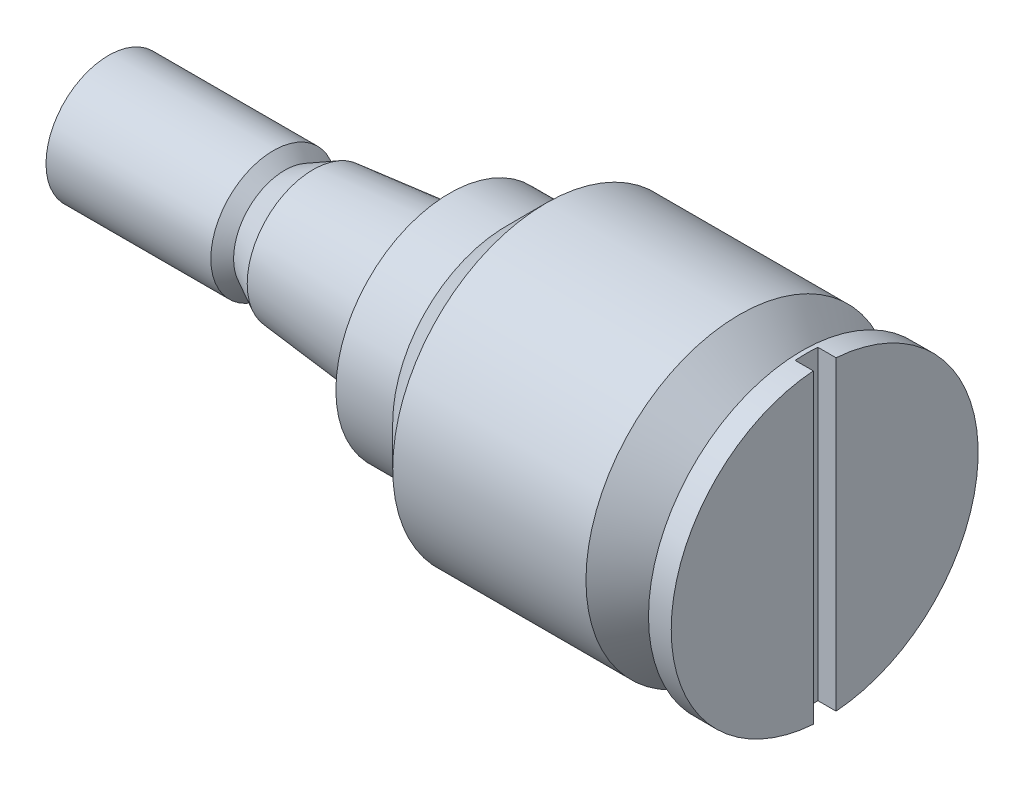
ISO-10303-21;
HEADER;
FILE_DESCRIPTION(('STEP AP214'),'2;1');
FILE_NAME('part.step','',(''),(''),'','','');
FILE_SCHEMA(('AUTOMOTIVE_DESIGN { 1 0 10303 214 1 1 1 1 }'));
ENDSEC;
DATA;
#1=APPLICATION_CONTEXT('core data for automotive mechanical design processes');
#2=APPLICATION_PROTOCOL_DEFINITION('international standard','automotive_design',2000,#1);
#3=PRODUCT_CONTEXT('',#1,'mechanical');
#4=PRODUCT('Part','Part','',(#3));
#5=PRODUCT_RELATED_PRODUCT_CATEGORY('part','',(#4));
#6=PRODUCT_DEFINITION_FORMATION('','',#4);
#7=PRODUCT_DEFINITION_CONTEXT('part definition',#1,'design');
#8=PRODUCT_DEFINITION('design','',#6,#7);
#9=PRODUCT_DEFINITION_SHAPE('','',#8);
#10=(LENGTH_UNIT() NAMED_UNIT(*) SI_UNIT(.MILLI.,.METRE.));
#11=(NAMED_UNIT(*) PLANE_ANGLE_UNIT() SI_UNIT($,.RADIAN.));
#12=(NAMED_UNIT(*) SI_UNIT($,.STERADIAN.) SOLID_ANGLE_UNIT());
#13=UNCERTAINTY_MEASURE_WITH_UNIT(LENGTH_MEASURE(1.E-05),#10,'distance_accuracy_value','');
#14=(GEOMETRIC_REPRESENTATION_CONTEXT(3) GLOBAL_UNCERTAINTY_ASSIGNED_CONTEXT((#13)) GLOBAL_UNIT_ASSIGNED_CONTEXT((#10,
#11,#12)) REPRESENTATION_CONTEXT('',''));
#15=CARTESIAN_POINT('',(0.,0.,0.));
#16=DIRECTION('',(0.,0.,1.));
#17=DIRECTION('',(1.,0.,0.));
#18=AXIS2_PLACEMENT_3D('',#15,#16,#17);
#19=CARTESIAN_POINT('',(31.5,0.,0.));
#20=DIRECTION('',(-1.,0.,0.));
#21=DIRECTION('',(0.,0.,1.));
#22=AXIS2_PLACEMENT_3D('',#19,#20,#21);
#23=PLANE('',#22);
#24=CARTESIAN_POINT('',(31.5,0.,0.));
#25=DIRECTION('',(-1.,0.,0.));
#26=DIRECTION('',(0.,0.,1.));
#27=AXIS2_PLACEMENT_3D('',#24,#25,#26);
#28=CIRCLE('',#27,13.5);
#29=CARTESIAN_POINT('',(31.5,13.4629120178363,-1.));
#30=VERTEX_POINT('',#29);
#31=CARTESIAN_POINT('',(31.5,-13.4629120178363,-1.));
#32=VERTEX_POINT('',#31);
#33=EDGE_CURVE('E91',#30,#32,#28,.T.);
#34=ORIENTED_EDGE('',*,*,#33,.F.);
#35=DIRECTION('',(0.,1.,0.));
#36=VECTOR('',#35,1.);
#37=CARTESIAN_POINT('',(31.5,-13.5,-1.));
#38=LINE('',#37,#36);
#39=EDGE_CURVE('E87',#32,#30,#38,.T.);
#40=ORIENTED_EDGE('',*,*,#39,.F.);
#41=EDGE_LOOP('',(#34,#40));
#42=FACE_BOUND('',#41,.T.);
#43=ADVANCED_FACE('F35',(#42),#23,.F.);
#44=CARTESIAN_POINT('',(-31.5,5.5,0.));
#45=DIRECTION('',(1.,0.,0.));
#46=DIRECTION('',(0.,0.,-1.));
#47=AXIS2_PLACEMENT_3D('',#44,#45,#46);
#48=PLANE('',#47);
#49=CARTESIAN_POINT('',(-31.5,0.,0.));
#50=DIRECTION('',(-1.,0.,0.));
#51=DIRECTION('',(0.,0.,1.));
#52=AXIS2_PLACEMENT_3D('',#49,#50,#51);
#53=CIRCLE('',#52,5.5);
#54=CARTESIAN_POINT('',(-31.5,0.,5.5));
#55=VERTEX_POINT('',#54);
#56=EDGE_CURVE('E109',#55,#55,#53,.T.);
#57=ORIENTED_EDGE('',*,*,#56,.T.);
#58=EDGE_LOOP('',(#57));
#59=FACE_BOUND('',#58,.T.);
#60=ADVANCED_FACE('F37',(#59),#48,.F.);
#61=CARTESIAN_POINT('',(31.5,-13.4629120178363,1.00000000000004));
#62=VERTEX_POINT('',#61);
#63=CARTESIAN_POINT('',(31.5,13.4629120178363,1.));
#64=VERTEX_POINT('',#63);
#65=EDGE_CURVE('E86',#62,#64,#28,.T.);
#66=ORIENTED_EDGE('',*,*,#65,.F.);
#67=DIRECTION('',(0.,1.,0.));
#68=VECTOR('',#67,1.);
#69=CARTESIAN_POINT('',(31.5,-13.5,1.));
#70=LINE('',#69,#68);
#71=EDGE_CURVE('E50',#62,#64,#70,.T.);
#72=ORIENTED_EDGE('',*,*,#71,.T.);
#73=EDGE_LOOP('',(#66,#72));
#74=FACE_BOUND('',#73,.T.);
#75=ADVANCED_FACE('F85',(#74),#23,.F.);
#76=CARTESIAN_POINT('',(-261.918227012937,0.,0.));
#77=DIRECTION('',(-1.,0.,0.));
#78=DIRECTION('',(0.,0.,1.));
#79=AXIS2_PLACEMENT_3D('',#76,#77,#78);
#80=CYLINDRICAL_SURFACE('',#79,13.5);
#81=CARTESIAN_POINT('',(29.5,0.,0.));
#82=DIRECTION('',(-1.,0.,0.));
#83=DIRECTION('',(0.,0.,1.));
#84=AXIS2_PLACEMENT_3D('',#81,#82,#83);
#85=CIRCLE('',#84,13.5);
#86=CARTESIAN_POINT('',(29.5,0.,13.5));
#87=VERTEX_POINT('',#86);
#88=EDGE_CURVE('E92',#87,#87,#85,.T.);
#89=ORIENTED_EDGE('',*,*,#88,.F.);
#90=EDGE_LOOP('',(#89));
#91=FACE_BOUND('',#90,.T.);
#92=DIRECTION('',(-1.,0.,0.));
#93=VECTOR('',#92,1.);
#94=CARTESIAN_POINT('',(-261.918227012937,-13.4629120178363,-0.999999999999921));
#95=LINE('',#94,#93);
#96=CARTESIAN_POINT('',(29.9,-13.4629120178363,-1.));
#97=VERTEX_POINT('',#96);
#98=EDGE_CURVE('E11',#32,#97,#95,.T.);
#99=ORIENTED_EDGE('',*,*,#98,.T.);
#100=CARTESIAN_POINT('',(29.9,0.,0.));
#101=DIRECTION('',(-1.,0.,0.));
#102=DIRECTION('',(0.,0.,1.));
#103=AXIS2_PLACEMENT_3D('',#100,#101,#102);
#104=CIRCLE('',#103,13.5);
#105=CARTESIAN_POINT('',(29.9,-13.4629120178363,1.));
#106=VERTEX_POINT('',#105);
#107=EDGE_CURVE('E102',#97,#106,#104,.T.);
#108=ORIENTED_EDGE('',*,*,#107,.T.);
#109=DIRECTION('',(-1.,0.,0.));
#110=VECTOR('',#109,1.);
#111=CARTESIAN_POINT('',(-261.918227012937,-13.4629120178363,1.00000000000004));
#112=LINE('',#111,#110);
#113=EDGE_CURVE('E82',#106,#62,#112,.F.);
#114=ORIENTED_EDGE('',*,*,#113,.T.);
#115=ORIENTED_EDGE('',*,*,#65,.T.);
#116=DIRECTION('',(-1.,0.,0.));
#117=VECTOR('',#116,1.);
#118=CARTESIAN_POINT('',(-261.918227012937,13.4629120178363,1.00000000000004));
#119=LINE('',#118,#117);
#120=CARTESIAN_POINT('',(29.9,13.4629120178363,1.));
#121=VERTEX_POINT('',#120);
#122=EDGE_CURVE('E43',#64,#121,#119,.T.);
#123=ORIENTED_EDGE('',*,*,#122,.T.);
#124=CARTESIAN_POINT('',(29.9,13.4629120178363,-1.));
#125=VERTEX_POINT('',#124);
#126=EDGE_CURVE('E95',#121,#125,#104,.T.);
#127=ORIENTED_EDGE('',*,*,#126,.T.);
#128=DIRECTION('',(-1.,0.,0.));
#129=VECTOR('',#128,1.);
#130=CARTESIAN_POINT('',(-261.918227012937,13.4629120178363,-0.999999999999921));
#131=LINE('',#130,#129);
#132=EDGE_CURVE('E58',#125,#30,#131,.F.);
#133=ORIENTED_EDGE('',*,*,#132,.T.);
#134=ORIENTED_EDGE('',*,*,#33,.T.);
#135=EDGE_LOOP('',(#99,#108,#114,#115,#123,#127,#133,#134));
#136=FACE_BOUND('',#135,.T.);
#137=ADVANCED_FACE('F89',(#91,#136),#80,.T.);
#138=CARTESIAN_POINT('',(29.5,13.5,0.));
#139=DIRECTION('',(1.,0.,0.));
#140=DIRECTION('',(0.,0.,-1.));
#141=AXIS2_PLACEMENT_3D('',#138,#139,#140);
#142=PLANE('',#141);
#143=CARTESIAN_POINT('',(29.5,0.,0.));
#144=DIRECTION('',(-1.,0.,0.));
#145=DIRECTION('',(0.,0.,1.));
#146=AXIS2_PLACEMENT_3D('',#143,#144,#145);
#147=CIRCLE('',#146,9.99999999999997);
#148=CARTESIAN_POINT('',(29.5,0.,9.99999999999997));
#149=VERTEX_POINT('',#148);
#150=EDGE_CURVE('E97',#149,#149,#147,.T.);
#151=ORIENTED_EDGE('',*,*,#150,.F.);
#152=EDGE_LOOP('',(#151));
#153=FACE_BOUND('',#152,.T.);
#154=ORIENTED_EDGE('',*,*,#88,.T.);
#155=EDGE_LOOP('',(#154));
#156=FACE_BOUND('',#155,.T.);
#157=ADVANCED_FACE('F147',(#153,#156),#142,.F.);
#158=CARTESIAN_POINT('',(-261.918227012937,0.,0.));
#159=DIRECTION('',(-1.,0.,0.));
#160=DIRECTION('',(0.,0.,1.));
#161=AXIS2_PLACEMENT_3D('',#158,#159,#160);
#162=CYLINDRICAL_SURFACE('',#161,9.99999999999998);
#163=CARTESIAN_POINT('',(27.5,0.,0.));
#164=DIRECTION('',(-1.,0.,0.));
#165=DIRECTION('',(0.,0.,1.));
#166=AXIS2_PLACEMENT_3D('',#163,#164,#165);
#167=CIRCLE('',#166,10.);
#168=CARTESIAN_POINT('',(27.5,0.,10.));
#169=VERTEX_POINT('',#168);
#170=EDGE_CURVE('E140',#169,#169,#167,.T.);
#171=ORIENTED_EDGE('',*,*,#170,.F.);
#172=EDGE_LOOP('',(#171));
#173=FACE_BOUND('',#172,.T.);
#174=ORIENTED_EDGE('',*,*,#150,.T.);
#175=EDGE_LOOP('',(#174));
#176=FACE_BOUND('',#175,.T.);
#177=ADVANCED_FACE('F145',(#173,#176),#162,.T.);
#178=CARTESIAN_POINT('',(27.5,0.,0.));
#179=DIRECTION('',(-1.,0.,0.));
#180=DIRECTION('',(0.,0.,1.));
#181=AXIS2_PLACEMENT_3D('',#178,#179,#180);
#182=CONICAL_SURFACE('',#181,10.,0.785398163397446);
#183=CARTESIAN_POINT('',(24.,0.,0.));
#184=DIRECTION('',(-1.,0.,0.));
#185=DIRECTION('',(0.,0.,1.));
#186=AXIS2_PLACEMENT_3D('',#183,#184,#185);
#187=CIRCLE('',#186,13.5);
#188=CARTESIAN_POINT('',(24.,0.,13.5));
#189=VERTEX_POINT('',#188);
#190=EDGE_CURVE('E137',#189,#189,#187,.T.);
#191=ORIENTED_EDGE('',*,*,#190,.F.);
#192=EDGE_LOOP('',(#191));
#193=FACE_BOUND('',#192,.T.);
#194=ORIENTED_EDGE('',*,*,#170,.T.);
#195=EDGE_LOOP('',(#194));
#196=FACE_BOUND('',#195,.T.);
#197=ADVANCED_FACE('F214',(#193,#196),#182,.T.);
#198=CARTESIAN_POINT('',(-261.918227012937,0.,0.));
#199=DIRECTION('',(-1.,0.,0.));
#200=DIRECTION('',(0.,0.,1.));
#201=AXIS2_PLACEMENT_3D('',#198,#199,#200);
#202=CYLINDRICAL_SURFACE('',#201,13.5);
#203=CARTESIAN_POINT('',(7.00000000000001,0.,0.));
#204=DIRECTION('',(-1.,0.,0.));
#205=DIRECTION('',(0.,0.,1.));
#206=AXIS2_PLACEMENT_3D('',#203,#204,#205);
#207=CIRCLE('',#206,13.5);
#208=CARTESIAN_POINT('',(7.00000000000001,0.,13.5));
#209=VERTEX_POINT('',#208);
#210=EDGE_CURVE('E134',#209,#209,#207,.T.);
#211=ORIENTED_EDGE('',*,*,#210,.F.);
#212=EDGE_LOOP('',(#211));
#213=FACE_BOUND('',#212,.T.);
#214=ORIENTED_EDGE('',*,*,#190,.T.);
#215=EDGE_LOOP('',(#214));
#216=FACE_BOUND('',#215,.T.);
#217=ADVANCED_FACE('F208',(#213,#216),#202,.T.);
#218=CARTESIAN_POINT('',(7.00000000000001,0.,0.));
#219=DIRECTION('',(1.,0.,0.));
#220=DIRECTION('',(0.,0.,-1.));
#221=AXIS2_PLACEMENT_3D('',#218,#219,#220);
#222=CONICAL_SURFACE('',#221,13.5,0.785398163397455);
#223=CARTESIAN_POINT('',(3.50000000000006,0.,0.));
#224=DIRECTION('',(-1.,0.,0.));
#225=DIRECTION('',(0.,0.,1.));
#226=AXIS2_PLACEMENT_3D('',#223,#224,#225);
#227=CIRCLE('',#226,9.99999999999999);
#228=CARTESIAN_POINT('',(3.50000000000006,0.,9.99999999999999));
#229=VERTEX_POINT('',#228);
#230=EDGE_CURVE('E131',#229,#229,#227,.T.);
#231=ORIENTED_EDGE('',*,*,#230,.F.);
#232=EDGE_LOOP('',(#231));
#233=FACE_BOUND('',#232,.T.);
#234=ORIENTED_EDGE('',*,*,#210,.T.);
#235=EDGE_LOOP('',(#234));
#236=FACE_BOUND('',#235,.T.);
#237=ADVANCED_FACE('F202',(#233,#236),#222,.T.);
#238=CARTESIAN_POINT('',(-261.918227012937,0.,0.));
#239=DIRECTION('',(-1.,0.,0.));
#240=DIRECTION('',(0.,0.,1.));
#241=AXIS2_PLACEMENT_3D('',#238,#239,#240);
#242=CYLINDRICAL_SURFACE('',#241,10.);
#243=CARTESIAN_POINT('',(-1.5,0.,0.));
#244=DIRECTION('',(-1.,0.,0.));
#245=DIRECTION('',(0.,0.,1.));
#246=AXIS2_PLACEMENT_3D('',#243,#244,#245);
#247=CIRCLE('',#246,10.);
#248=CARTESIAN_POINT('',(-1.5,0.,10.));
#249=VERTEX_POINT('',#248);
#250=EDGE_CURVE('E128',#249,#249,#247,.T.);
#251=ORIENTED_EDGE('',*,*,#250,.F.);
#252=EDGE_LOOP('',(#251));
#253=FACE_BOUND('',#252,.T.);
#254=ORIENTED_EDGE('',*,*,#230,.T.);
#255=EDGE_LOOP('',(#254));
#256=FACE_BOUND('',#255,.T.);
#257=ADVANCED_FACE('F196',(#253,#256),#242,.T.);
#258=CARTESIAN_POINT('',(-1.5,7.,0.));
#259=DIRECTION('',(1.,0.,0.));
#260=DIRECTION('',(0.,0.,-1.));
#261=AXIS2_PLACEMENT_3D('',#258,#259,#260);
#262=PLANE('',#261);
#263=CARTESIAN_POINT('',(-1.5,0.,0.));
#264=DIRECTION('',(-1.,0.,0.));
#265=DIRECTION('',(0.,0.,1.));
#266=AXIS2_PLACEMENT_3D('',#263,#264,#265);
#267=CIRCLE('',#266,7.);
#268=CARTESIAN_POINT('',(-1.5,0.,7.));
#269=VERTEX_POINT('',#268);
#270=EDGE_CURVE('E125',#269,#269,#267,.T.);
#271=ORIENTED_EDGE('',*,*,#270,.F.);
#272=EDGE_LOOP('',(#271));
#273=FACE_BOUND('',#272,.T.);
#274=ORIENTED_EDGE('',*,*,#250,.T.);
#275=EDGE_LOOP('',(#274));
#276=FACE_BOUND('',#275,.T.);
#277=ADVANCED_FACE('F190',(#273,#276),#262,.F.);
#278=CARTESIAN_POINT('',(-1.5,0.,0.));
#279=DIRECTION('',(1.,0.,0.));
#280=DIRECTION('',(0.,0.,-1.));
#281=AXIS2_PLACEMENT_3D('',#278,#279,#280);
#282=CONICAL_SURFACE('',#281,7.,0.0996686524911621);
#283=CARTESIAN_POINT('',(-13.5,0.,0.));
#284=DIRECTION('',(-1.,0.,0.));
#285=DIRECTION('',(0.,0.,1.));
#286=AXIS2_PLACEMENT_3D('',#283,#284,#285);
#287=CIRCLE('',#286,5.8);
#288=CARTESIAN_POINT('',(-13.5,0.,5.8));
#289=VERTEX_POINT('',#288);
#290=EDGE_CURVE('E122',#289,#289,#287,.T.);
#291=ORIENTED_EDGE('',*,*,#290,.F.);
#292=EDGE_LOOP('',(#291));
#293=FACE_BOUND('',#292,.T.);
#294=ORIENTED_EDGE('',*,*,#270,.T.);
#295=EDGE_LOOP('',(#294));
#296=FACE_BOUND('',#295,.T.);
#297=ADVANCED_FACE('F184',(#293,#296),#282,.T.);
#298=CARTESIAN_POINT('',(-13.5,0.,0.));
#299=DIRECTION('',(1.,0.,0.));
#300=DIRECTION('',(0.,0.,-1.));
#301=AXIS2_PLACEMENT_3D('',#298,#299,#300);
#302=CONICAL_SURFACE('',#301,5.8,0.479519291992596);
#303=CARTESIAN_POINT('',(-16.,0.,0.));
#304=DIRECTION('',(-1.,0.,0.));
#305=DIRECTION('',(0.,0.,1.));
#306=AXIS2_PLACEMENT_3D('',#303,#304,#305);
#307=CIRCLE('',#306,4.5);
#308=CARTESIAN_POINT('',(-16.,0.,4.5));
#309=VERTEX_POINT('',#308);
#310=EDGE_CURVE('E119',#309,#309,#307,.T.);
#311=ORIENTED_EDGE('',*,*,#310,.F.);
#312=EDGE_LOOP('',(#311));
#313=FACE_BOUND('',#312,.T.);
#314=ORIENTED_EDGE('',*,*,#290,.T.);
#315=EDGE_LOOP('',(#314));
#316=FACE_BOUND('',#315,.T.);
#317=ADVANCED_FACE('F178',(#313,#316),#302,.T.);
#318=CARTESIAN_POINT('',(-16.,0.,0.));
#319=DIRECTION('',(-1.,0.,0.));
#320=DIRECTION('',(0.,0.,1.));
#321=AXIS2_PLACEMENT_3D('',#318,#319,#320);
#322=CONICAL_SURFACE('',#321,4.5,0.785398163397448);
#323=CARTESIAN_POINT('',(-17.,0.,0.));
#324=DIRECTION('',(-1.,0.,0.));
#325=DIRECTION('',(0.,0.,1.));
#326=AXIS2_PLACEMENT_3D('',#323,#324,#325);
#327=CIRCLE('',#326,5.5);
#328=CARTESIAN_POINT('',(-17.,0.,5.5));
#329=VERTEX_POINT('',#328);
#330=EDGE_CURVE('E112',#329,#329,#327,.T.);
#331=ORIENTED_EDGE('',*,*,#330,.F.);
#332=EDGE_LOOP('',(#331));
#333=FACE_BOUND('',#332,.T.);
#334=ORIENTED_EDGE('',*,*,#310,.T.);
#335=EDGE_LOOP('',(#334));
#336=FACE_BOUND('',#335,.T.);
#337=ADVANCED_FACE('F172',(#333,#336),#322,.T.);
#338=CARTESIAN_POINT('',(-261.918227012937,0.,0.));
#339=DIRECTION('',(-1.,0.,0.));
#340=DIRECTION('',(0.,0.,1.));
#341=AXIS2_PLACEMENT_3D('',#338,#339,#340);
#342=CYLINDRICAL_SURFACE('',#341,5.5);
#343=ORIENTED_EDGE('',*,*,#56,.F.);
#344=EDGE_LOOP('',(#343));
#345=FACE_BOUND('',#344,.T.);
#346=ORIENTED_EDGE('',*,*,#330,.T.);
#347=EDGE_LOOP('',(#346));
#348=FACE_BOUND('',#347,.T.);
#349=ADVANCED_FACE('F169',(#345,#348),#342,.T.);
#350=CARTESIAN_POINT('',(29.9,-13.5,-1.));
#351=DIRECTION('',(-1.,0.,0.));
#352=DIRECTION('',(0.,0.,1.));
#353=AXIS2_PLACEMENT_3D('',#350,#351,#352);
#354=PLANE('',#353);
#355=DIRECTION('',(0.,1.,0.));
#356=VECTOR('',#355,1.);
#357=CARTESIAN_POINT('',(29.9,-13.5,1.));
#358=LINE('',#357,#356);
#359=EDGE_CURVE('E78',#106,#121,#358,.T.);
#360=ORIENTED_EDGE('',*,*,#359,.F.);
#361=ORIENTED_EDGE('',*,*,#107,.F.);
#362=DIRECTION('',(0.,1.,0.));
#363=VECTOR('',#362,1.);
#364=CARTESIAN_POINT('',(29.9,-13.5,-1.));
#365=LINE('',#364,#363);
#366=EDGE_CURVE('E106',#97,#125,#365,.T.);
#367=ORIENTED_EDGE('',*,*,#366,.T.);
#368=ORIENTED_EDGE('',*,*,#126,.F.);
#369=EDGE_LOOP('',(#360,#361,#367,#368));
#370=FACE_BOUND('',#369,.T.);
#371=ADVANCED_FACE('F105',(#370),#354,.F.);
#372=CARTESIAN_POINT('',(31.5,-13.5,-1.));
#373=DIRECTION('',(0.,0.,-1.));
#374=DIRECTION('',(-1.,0.,0.));
#375=AXIS2_PLACEMENT_3D('',#372,#373,#374);
#376=PLANE('',#375);
#377=ORIENTED_EDGE('',*,*,#39,.T.);
#378=ORIENTED_EDGE('',*,*,#132,.F.);
#379=ORIENTED_EDGE('',*,*,#366,.F.);
#380=ORIENTED_EDGE('',*,*,#98,.F.);
#381=EDGE_LOOP('',(#377,#378,#379,#380));
#382=FACE_BOUND('',#381,.T.);
#383=ADVANCED_FACE('F107',(#382),#376,.F.);
#384=CARTESIAN_POINT('',(31.5,-13.5,1.));
#385=DIRECTION('',(0.,0.,1.));
#386=DIRECTION('',(1.,0.,0.));
#387=AXIS2_PLACEMENT_3D('',#384,#385,#386);
#388=PLANE('',#387);
#389=ORIENTED_EDGE('',*,*,#71,.F.);
#390=ORIENTED_EDGE('',*,*,#113,.F.);
#391=ORIENTED_EDGE('',*,*,#359,.T.);
#392=ORIENTED_EDGE('',*,*,#122,.F.);
#393=EDGE_LOOP('',(#389,#390,#391,#392));
#394=FACE_BOUND('',#393,.T.);
#395=ADVANCED_FACE('F76',(#394),#388,.F.);
#396=CLOSED_SHELL('',(#43,#60,#75,#137,#157,#177,#197,#217,#237,#257,#277,#297,#317,#337,#349,
#371,#383,#395));
#397=MANIFOLD_SOLID_BREP('B2',#396);
#398=ADVANCED_BREP_SHAPE_REPRESENTATION('',(#18,#397),#14);
#399=SHAPE_DEFINITION_REPRESENTATION(#9,#398);
ENDSEC;
END-ISO-10303-21;
